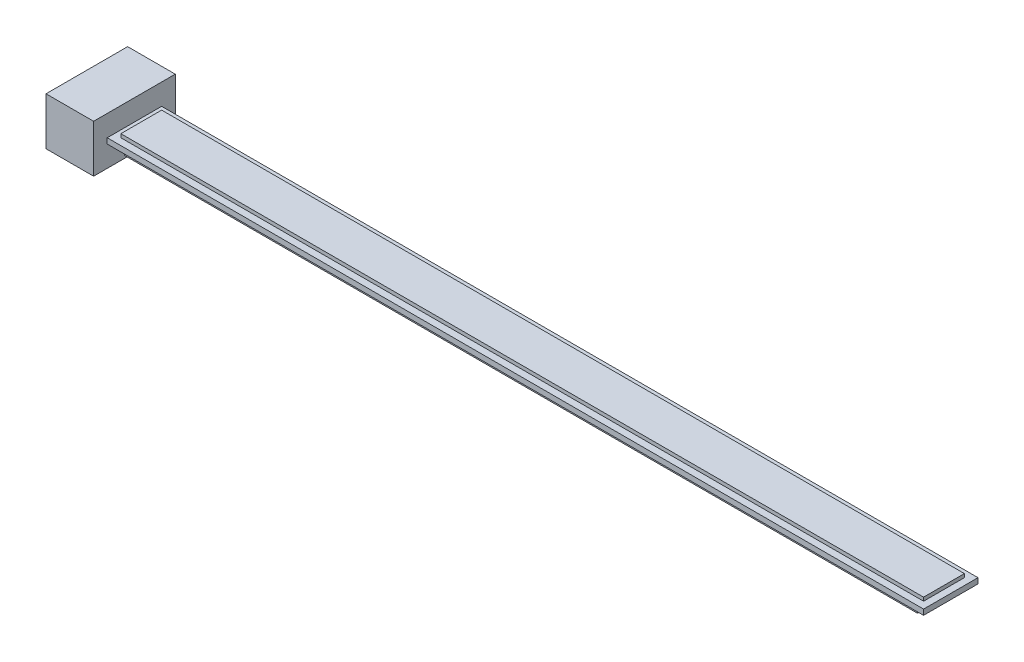
ISO-10303-21;
HEADER;
FILE_DESCRIPTION(('STEP AP214'),'2;1');
FILE_NAME('part.step','',(''),(''),'','','');
FILE_SCHEMA(('AUTOMOTIVE_DESIGN { 1 0 10303 214 1 1 1 1 }'));
ENDSEC;
DATA;
#1=APPLICATION_CONTEXT('core data for automotive mechanical design processes');
#2=APPLICATION_PROTOCOL_DEFINITION('international standard','automotive_design',2000,#1);
#3=PRODUCT_CONTEXT('',#1,'mechanical');
#4=PRODUCT('Part','Part','',(#3));
#5=PRODUCT_RELATED_PRODUCT_CATEGORY('part','',(#4));
#6=PRODUCT_DEFINITION_FORMATION('','',#4);
#7=PRODUCT_DEFINITION_CONTEXT('part definition',#1,'design');
#8=PRODUCT_DEFINITION('design','',#6,#7);
#9=PRODUCT_DEFINITION_SHAPE('','',#8);
#10=(LENGTH_UNIT() NAMED_UNIT(*) SI_UNIT(.MILLI.,.METRE.));
#11=(NAMED_UNIT(*) PLANE_ANGLE_UNIT() SI_UNIT($,.RADIAN.));
#12=(NAMED_UNIT(*) SI_UNIT($,.STERADIAN.) SOLID_ANGLE_UNIT());
#13=UNCERTAINTY_MEASURE_WITH_UNIT(LENGTH_MEASURE(1.E-05),#10,'distance_accuracy_value','');
#14=(GEOMETRIC_REPRESENTATION_CONTEXT(3) GLOBAL_UNCERTAINTY_ASSIGNED_CONTEXT((#13)) GLOBAL_UNIT_ASSIGNED_CONTEXT((#10,
#11,#12)) REPRESENTATION_CONTEXT('',''));
#15=CARTESIAN_POINT('',(0.,0.,0.));
#16=DIRECTION('',(0.,0.,1.));
#17=DIRECTION('',(1.,0.,0.));
#18=AXIS2_PLACEMENT_3D('',#15,#16,#17);
#19=CARTESIAN_POINT('',(617.5,-2.,50.));
#20=DIRECTION('',(0.,1.,0.));
#21=DIRECTION('',(0.,0.,1.));
#22=AXIS2_PLACEMENT_3D('',#19,#20,#21);
#23=PLANE('',#22);
#24=DIRECTION('',(1.,0.,0.));
#25=VECTOR('',#24,1.);
#26=CARTESIAN_POINT('',(26.1029293776079,-2.,23.1811179422744));
#27=LINE('',#26,#25);
#28=CARTESIAN_POINT('',(26.1029293776079,-2.,23.1811179422744));
#29=VERTEX_POINT('',#28);
#30=CARTESIAN_POINT('',(608.897070622392,-2.,23.1811179422744));
#31=VERTEX_POINT('',#30);
#32=EDGE_CURVE('E205',#29,#31,#27,.T.);
#33=ORIENTED_EDGE('',*,*,#32,.T.);
#34=DIRECTION('',(0.,0.,-1.));
#35=VECTOR('',#34,1.);
#36=CARTESIAN_POINT('',(608.897070622392,-2.,14.0892751986402));
#37=LINE('',#36,#35);
#38=CARTESIAN_POINT('',(608.897070622392,-2.,14.0892751986402));
#39=VERTEX_POINT('',#38);
#40=EDGE_CURVE('E179',#31,#39,#37,.T.);
#41=ORIENTED_EDGE('',*,*,#40,.T.);
#42=DIRECTION('',(-1.,0.,0.));
#43=VECTOR('',#42,1.);
#44=CARTESIAN_POINT('',(26.1029293776079,-2.,14.0892751986402));
#45=LINE('',#44,#43);
#46=CARTESIAN_POINT('',(26.1029293776079,-2.,14.0892751986402));
#47=VERTEX_POINT('',#46);
#48=EDGE_CURVE('E195',#39,#47,#45,.T.);
#49=ORIENTED_EDGE('',*,*,#48,.T.);
#50=DIRECTION('',(0.,0.,1.));
#51=VECTOR('',#50,1.);
#52=CARTESIAN_POINT('',(26.1029293776079,-2.,14.0892751986402));
#53=LINE('',#52,#51);
#54=EDGE_CURVE('E52',#47,#29,#53,.T.);
#55=ORIENTED_EDGE('',*,*,#54,.T.);
#56=EDGE_LOOP('',(#33,#41,#49,#55));
#57=FACE_BOUND('',#56,.T.);
#58=DIRECTION('',(0.,0.,-1.));
#59=VECTOR('',#58,1.);
#60=CARTESIAN_POINT('',(17.5,-2.,50.));
#61=LINE('',#60,#59);
#62=CARTESIAN_POINT('',(17.5,-1.99999999999999,50.));
#63=VERTEX_POINT('',#62);
#64=CARTESIAN_POINT('',(17.5,-2.,10.));
#65=VERTEX_POINT('',#64);
#66=EDGE_CURVE('E278',#63,#65,#61,.T.);
#67=ORIENTED_EDGE('',*,*,#66,.T.);
#68=DIRECTION('',(-1.,0.,0.));
#69=VECTOR('',#68,1.);
#70=CARTESIAN_POINT('',(617.5,-2.,10.));
#71=LINE('',#70,#69);
#72=CARTESIAN_POINT('',(617.5,-2.,10.));
#73=VERTEX_POINT('',#72);
#74=EDGE_CURVE('E284',#73,#65,#71,.T.);
#75=ORIENTED_EDGE('',*,*,#74,.F.);
#76=DIRECTION('',(0.,0.,-1.));
#77=VECTOR('',#76,1.);
#78=CARTESIAN_POINT('',(617.5,-2.,50.));
#79=LINE('',#78,#77);
#80=CARTESIAN_POINT('',(617.5,-2.,50.));
#81=VERTEX_POINT('',#80);
#82=EDGE_CURVE('E282',#81,#73,#79,.T.);
#83=ORIENTED_EDGE('',*,*,#82,.F.);
#84=DIRECTION('',(-1.,0.,0.));
#85=VECTOR('',#84,1.);
#86=CARTESIAN_POINT('',(617.5,-2.,50.));
#87=LINE('',#86,#85);
#88=EDGE_CURVE('E295',#81,#63,#87,.T.);
#89=ORIENTED_EDGE('',*,*,#88,.T.);
#90=EDGE_LOOP('',(#67,#75,#83,#89));
#91=FACE_BOUND('',#90,.T.);
#92=DIRECTION('',(0.,0.,1.));
#93=VECTOR('',#92,1.);
#94=CARTESIAN_POINT('',(608.897070622392,-2.,45.9107248013598));
#95=LINE('',#94,#93);
#96=CARTESIAN_POINT('',(608.897070622392,-2.,36.8188820577256));
#97=VERTEX_POINT('',#96);
#98=CARTESIAN_POINT('',(608.897070622392,-2.,45.9107248013598));
#99=VERTEX_POINT('',#98);
#100=EDGE_CURVE('E184',#97,#99,#95,.T.);
#101=ORIENTED_EDGE('',*,*,#100,.F.);
#102=DIRECTION('',(1.,0.,0.));
#103=VECTOR('',#102,1.);
#104=CARTESIAN_POINT('',(26.1029293776079,-2.,36.8188820577256));
#105=LINE('',#104,#103);
#106=CARTESIAN_POINT('',(26.1029293776079,-2.,36.8188820577256));
#107=VERTEX_POINT('',#106);
#108=EDGE_CURVE('E218',#107,#97,#105,.T.);
#109=ORIENTED_EDGE('',*,*,#108,.F.);
#110=DIRECTION('',(0.,0.,-1.));
#111=VECTOR('',#110,1.);
#112=CARTESIAN_POINT('',(26.1029293776079,-2.,45.9107248013598));
#113=LINE('',#112,#111);
#114=CARTESIAN_POINT('',(26.1029293776079,-2.,45.9107248013598));
#115=VERTEX_POINT('',#114);
#116=EDGE_CURVE('E228',#115,#107,#113,.T.);
#117=ORIENTED_EDGE('',*,*,#116,.F.);
#118=DIRECTION('',(-1.,0.,0.));
#119=VECTOR('',#118,1.);
#120=CARTESIAN_POINT('',(26.1029293776079,-2.,45.9107248013598));
#121=LINE('',#120,#119);
#122=EDGE_CURVE('E60',#99,#115,#121,.T.);
#123=ORIENTED_EDGE('',*,*,#122,.F.);
#124=EDGE_LOOP('',(#101,#109,#117,#123));
#125=FACE_BOUND('',#124,.T.);
#126=ADVANCED_FACE('F37',(#57,#91,#125),#23,.F.);
#127=CARTESIAN_POINT('',(17.5,17.5,60.));
#128=DIRECTION('',(1.,0.,0.));
#129=DIRECTION('',(0.,1.,0.));
#130=AXIS2_PLACEMENT_3D('',#127,#128,#129);
#131=PLANE('',#130);
#132=DIRECTION('',(0.,-1.,0.));
#133=VECTOR('',#132,1.);
#134=CARTESIAN_POINT('',(17.5,17.5,0.));
#135=LINE('',#134,#133);
#136=CARTESIAN_POINT('',(17.5,17.5,0.));
#137=VERTEX_POINT('',#136);
#138=CARTESIAN_POINT('',(17.5,-17.5,0.));
#139=VERTEX_POINT('',#138);
#140=EDGE_CURVE('E317',#137,#139,#135,.T.);
#141=ORIENTED_EDGE('',*,*,#140,.F.);
#142=DIRECTION('',(0.,0.,-1.));
#143=VECTOR('',#142,1.);
#144=CARTESIAN_POINT('',(17.5,17.5,60.));
#145=LINE('',#144,#143);
#146=CARTESIAN_POINT('',(17.5,17.5,60.));
#147=VERTEX_POINT('',#146);
#148=EDGE_CURVE('E45',#147,#137,#145,.T.);
#149=ORIENTED_EDGE('',*,*,#148,.F.);
#150=DIRECTION('',(0.,-1.,0.));
#151=VECTOR('',#150,1.);
#152=CARTESIAN_POINT('',(17.5,17.5,60.));
#153=LINE('',#152,#151);
#154=CARTESIAN_POINT('',(17.5,-17.5,60.));
#155=VERTEX_POINT('',#154);
#156=EDGE_CURVE('E305',#147,#155,#153,.T.);
#157=ORIENTED_EDGE('',*,*,#156,.T.);
#158=DIRECTION('',(0.,0.,-1.));
#159=VECTOR('',#158,1.);
#160=CARTESIAN_POINT('',(17.5,-17.5,60.));
#161=LINE('',#160,#159);
#162=EDGE_CURVE('E11',#155,#139,#161,.T.);
#163=ORIENTED_EDGE('',*,*,#162,.T.);
#164=EDGE_LOOP('',(#141,#149,#157,#163));
#165=FACE_BOUND('',#164,.T.);
#166=DIRECTION('',(0.,0.,1.));
#167=VECTOR('',#166,1.);
#168=CARTESIAN_POINT('',(17.5,2.,50.));
#169=LINE('',#168,#167);
#170=CARTESIAN_POINT('',(17.5,2.,10.));
#171=VERTEX_POINT('',#170);
#172=CARTESIAN_POINT('',(17.5,2.,50.));
#173=VERTEX_POINT('',#172);
#174=EDGE_CURVE('E287',#171,#173,#169,.T.);
#175=ORIENTED_EDGE('',*,*,#174,.F.);
#176=DIRECTION('',(0.,1.,0.));
#177=VECTOR('',#176,1.);
#178=CARTESIAN_POINT('',(17.5,2.,10.));
#179=LINE('',#178,#177);
#180=EDGE_CURVE('E266',#65,#171,#179,.T.);
#181=ORIENTED_EDGE('',*,*,#180,.F.);
#182=ORIENTED_EDGE('',*,*,#66,.F.);
#183=DIRECTION('',(0.,-1.,0.));
#184=VECTOR('',#183,1.);
#185=CARTESIAN_POINT('',(17.5,2.,50.));
#186=LINE('',#185,#184);
#187=EDGE_CURVE('E289',#173,#63,#186,.T.);
#188=ORIENTED_EDGE('',*,*,#187,.F.);
#189=EDGE_LOOP('',(#175,#181,#182,#188));
#190=FACE_BOUND('',#189,.T.);
#191=ADVANCED_FACE('F334',(#165,#190),#131,.T.);
#192=CARTESIAN_POINT('',(-17.5,-17.5,60.));
#193=DIRECTION('',(0.,1.,0.));
#194=DIRECTION('',(0.,0.,1.));
#195=AXIS2_PLACEMENT_3D('',#192,#193,#194);
#196=PLANE('',#195);
#197=DIRECTION('',(1.,0.,0.));
#198=VECTOR('',#197,1.);
#199=CARTESIAN_POINT('',(-17.5,-17.5,0.));
#200=LINE('',#199,#198);
#201=CARTESIAN_POINT('',(-17.5,-17.5,0.));
#202=VERTEX_POINT('',#201);
#203=EDGE_CURVE('E302',#202,#139,#200,.T.);
#204=ORIENTED_EDGE('',*,*,#203,.T.);
#205=ORIENTED_EDGE('',*,*,#162,.F.);
#206=DIRECTION('',(1.,0.,0.));
#207=VECTOR('',#206,1.);
#208=CARTESIAN_POINT('',(-17.5,-17.5,60.));
#209=LINE('',#208,#207);
#210=CARTESIAN_POINT('',(-17.5,-17.5,60.));
#211=VERTEX_POINT('',#210);
#212=EDGE_CURVE('E303',#211,#155,#209,.T.);
#213=ORIENTED_EDGE('',*,*,#212,.F.);
#214=DIRECTION('',(0.,0.,-1.));
#215=VECTOR('',#214,1.);
#216=CARTESIAN_POINT('',(-17.5,-17.5,60.));
#217=LINE('',#216,#215);
#218=EDGE_CURVE('E314',#211,#202,#217,.T.);
#219=ORIENTED_EDGE('',*,*,#218,.T.);
#220=EDGE_LOOP('',(#204,#205,#213,#219));
#221=FACE_BOUND('',#220,.T.);
#222=ADVANCED_FACE('F39',(#221),#196,.F.);
#223=CARTESIAN_POINT('',(-17.5,17.5,60.));
#224=DIRECTION('',(0.,1.,0.));
#225=DIRECTION('',(0.,0.,1.));
#226=AXIS2_PLACEMENT_3D('',#223,#224,#225);
#227=PLANE('',#226);
#228=DIRECTION('',(1.,0.,0.));
#229=VECTOR('',#228,1.);
#230=CARTESIAN_POINT('',(-17.5,17.5,0.));
#231=LINE('',#230,#229);
#232=CARTESIAN_POINT('',(-17.5,17.5,0.));
#233=VERTEX_POINT('',#232);
#234=EDGE_CURVE('E320',#233,#137,#231,.T.);
#235=ORIENTED_EDGE('',*,*,#234,.F.);
#236=DIRECTION('',(0.,0.,-1.));
#237=VECTOR('',#236,1.);
#238=CARTESIAN_POINT('',(-17.5,17.5,60.));
#239=LINE('',#238,#237);
#240=CARTESIAN_POINT('',(-17.5,17.5,60.));
#241=VERTEX_POINT('',#240);
#242=EDGE_CURVE('E326',#241,#233,#239,.T.);
#243=ORIENTED_EDGE('',*,*,#242,.F.);
#244=DIRECTION('',(1.,0.,0.));
#245=VECTOR('',#244,1.);
#246=CARTESIAN_POINT('',(-17.5,17.5,60.));
#247=LINE('',#246,#245);
#248=EDGE_CURVE('E309',#241,#147,#247,.T.);
#249=ORIENTED_EDGE('',*,*,#248,.T.);
#250=ORIENTED_EDGE('',*,*,#148,.T.);
#251=EDGE_LOOP('',(#235,#243,#249,#250));
#252=FACE_BOUND('',#251,.T.);
#253=ADVANCED_FACE('F330',(#252),#227,.T.);
#254=CARTESIAN_POINT('',(-17.5,17.5,60.));
#255=DIRECTION('',(1.,0.,0.));
#256=DIRECTION('',(0.,1.,0.));
#257=AXIS2_PLACEMENT_3D('',#254,#255,#256);
#258=PLANE('',#257);
#259=DIRECTION('',(0.,-1.,0.));
#260=VECTOR('',#259,1.);
#261=CARTESIAN_POINT('',(-17.5,17.5,0.));
#262=LINE('',#261,#260);
#263=EDGE_CURVE('E306',#233,#202,#262,.T.);
#264=ORIENTED_EDGE('',*,*,#263,.T.);
#265=ORIENTED_EDGE('',*,*,#218,.F.);
#266=DIRECTION('',(0.,-1.,0.));
#267=VECTOR('',#266,1.);
#268=CARTESIAN_POINT('',(-17.5,17.5,60.));
#269=LINE('',#268,#267);
#270=EDGE_CURVE('E312',#241,#211,#269,.T.);
#271=ORIENTED_EDGE('',*,*,#270,.F.);
#272=ORIENTED_EDGE('',*,*,#242,.T.);
#273=EDGE_LOOP('',(#264,#265,#271,#272));
#274=FACE_BOUND('',#273,.T.);
#275=ADVANCED_FACE('F343',(#274),#258,.F.);
#276=CARTESIAN_POINT('',(0.,0.,60.));
#277=DIRECTION('',(0.,0.,-1.));
#278=DIRECTION('',(-1.,0.,0.));
#279=AXIS2_PLACEMENT_3D('',#276,#277,#278);
#280=PLANE('',#279);
#281=ORIENTED_EDGE('',*,*,#212,.T.);
#282=ORIENTED_EDGE('',*,*,#156,.F.);
#283=ORIENTED_EDGE('',*,*,#248,.F.);
#284=ORIENTED_EDGE('',*,*,#270,.T.);
#285=EDGE_LOOP('',(#281,#282,#283,#284));
#286=FACE_BOUND('',#285,.T.);
#287=ADVANCED_FACE('F348',(#286),#280,.F.);
#288=CARTESIAN_POINT('',(0.,0.,0.));
#289=DIRECTION('',(0.,0.,-1.));
#290=DIRECTION('',(-1.,0.,0.));
#291=AXIS2_PLACEMENT_3D('',#288,#289,#290);
#292=PLANE('',#291);
#293=ORIENTED_EDGE('',*,*,#203,.F.);
#294=ORIENTED_EDGE('',*,*,#263,.F.);
#295=ORIENTED_EDGE('',*,*,#234,.T.);
#296=ORIENTED_EDGE('',*,*,#140,.T.);
#297=EDGE_LOOP('',(#293,#294,#295,#296));
#298=FACE_BOUND('',#297,.T.);
#299=ADVANCED_FACE('F340',(#298),#292,.T.);
#300=CARTESIAN_POINT('',(617.5,2.,10.));
#301=DIRECTION('',(0.,0.,1.));
#302=DIRECTION('',(1.,0.,0.));
#303=AXIS2_PLACEMENT_3D('',#300,#301,#302);
#304=PLANE('',#303);
#305=ORIENTED_EDGE('',*,*,#180,.T.);
#306=DIRECTION('',(-1.,0.,0.));
#307=VECTOR('',#306,1.);
#308=CARTESIAN_POINT('',(617.5,2.,10.));
#309=LINE('',#308,#307);
#310=CARTESIAN_POINT('',(617.5,2.,10.));
#311=VERTEX_POINT('',#310);
#312=EDGE_CURVE('E300',#311,#171,#309,.T.);
#313=ORIENTED_EDGE('',*,*,#312,.F.);
#314=DIRECTION('',(0.,1.,0.));
#315=VECTOR('',#314,1.);
#316=CARTESIAN_POINT('',(617.5,2.,10.));
#317=LINE('',#316,#315);
#318=EDGE_CURVE('E274',#73,#311,#317,.T.);
#319=ORIENTED_EDGE('',*,*,#318,.F.);
#320=ORIENTED_EDGE('',*,*,#74,.T.);
#321=EDGE_LOOP('',(#305,#313,#319,#320));
#322=FACE_BOUND('',#321,.T.);
#323=ADVANCED_FACE('F355',(#322),#304,.F.);
#324=CARTESIAN_POINT('',(617.5,2.,50.));
#325=DIRECTION('',(0.,-1.,0.));
#326=DIRECTION('',(0.,0.,-1.));
#327=AXIS2_PLACEMENT_3D('',#324,#325,#326);
#328=PLANE('',#327);
#329=DIRECTION('',(0.,0.,1.));
#330=VECTOR('',#329,1.);
#331=CARTESIAN_POINT('',(22.5,2.,15.));
#332=LINE('',#331,#330);
#333=CARTESIAN_POINT('',(22.5,2.,15.));
#334=VERTEX_POINT('',#333);
#335=CARTESIAN_POINT('',(22.5,2.,45.));
#336=VERTEX_POINT('',#335);
#337=EDGE_CURVE('E248',#334,#336,#332,.T.);
#338=ORIENTED_EDGE('',*,*,#337,.F.);
#339=DIRECTION('',(1.,0.,0.));
#340=VECTOR('',#339,1.);
#341=CARTESIAN_POINT('',(22.5,2.,15.));
#342=LINE('',#341,#340);
#343=CARTESIAN_POINT('',(612.5,2.,15.));
#344=VERTEX_POINT('',#343);
#345=EDGE_CURVE('E243',#334,#344,#342,.T.);
#346=ORIENTED_EDGE('',*,*,#345,.T.);
#347=DIRECTION('',(0.,0.,1.));
#348=VECTOR('',#347,1.);
#349=CARTESIAN_POINT('',(612.5,2.,15.));
#350=LINE('',#349,#348);
#351=CARTESIAN_POINT('',(612.5,2.,45.));
#352=VERTEX_POINT('',#351);
#353=EDGE_CURVE('E258',#344,#352,#350,.T.);
#354=ORIENTED_EDGE('',*,*,#353,.T.);
#355=DIRECTION('',(1.,0.,0.));
#356=VECTOR('',#355,1.);
#357=CARTESIAN_POINT('',(22.5,2.,45.));
#358=LINE('',#357,#356);
#359=EDGE_CURVE('E261',#336,#352,#358,.T.);
#360=ORIENTED_EDGE('',*,*,#359,.F.);
#361=EDGE_LOOP('',(#338,#346,#354,#360));
#362=FACE_BOUND('',#361,.T.);
#363=ORIENTED_EDGE('',*,*,#174,.T.);
#364=DIRECTION('',(-1.,0.,0.));
#365=VECTOR('',#364,1.);
#366=CARTESIAN_POINT('',(617.5,2.,50.));
#367=LINE('',#366,#365);
#368=CARTESIAN_POINT('',(617.5,2.,50.));
#369=VERTEX_POINT('',#368);
#370=EDGE_CURVE('E297',#369,#173,#367,.T.);
#371=ORIENTED_EDGE('',*,*,#370,.F.);
#372=DIRECTION('',(0.,0.,1.));
#373=VECTOR('',#372,1.);
#374=CARTESIAN_POINT('',(617.5,2.,50.));
#375=LINE('',#374,#373);
#376=EDGE_CURVE('E277',#311,#369,#375,.T.);
#377=ORIENTED_EDGE('',*,*,#376,.F.);
#378=ORIENTED_EDGE('',*,*,#312,.T.);
#379=EDGE_LOOP('',(#363,#371,#377,#378));
#380=FACE_BOUND('',#379,.T.);
#381=ADVANCED_FACE('F373',(#362,#380),#328,.F.);
#382=CARTESIAN_POINT('',(617.5,2.,50.));
#383=DIRECTION('',(0.,0.,-1.));
#384=DIRECTION('',(-1.,0.,0.));
#385=AXIS2_PLACEMENT_3D('',#382,#383,#384);
#386=PLANE('',#385);
#387=ORIENTED_EDGE('',*,*,#187,.T.);
#388=ORIENTED_EDGE('',*,*,#88,.F.);
#389=DIRECTION('',(0.,-1.,0.));
#390=VECTOR('',#389,1.);
#391=CARTESIAN_POINT('',(617.5,2.,50.));
#392=LINE('',#391,#390);
#393=EDGE_CURVE('E280',#369,#81,#392,.T.);
#394=ORIENTED_EDGE('',*,*,#393,.F.);
#395=ORIENTED_EDGE('',*,*,#370,.T.);
#396=EDGE_LOOP('',(#387,#388,#394,#395));
#397=FACE_BOUND('',#396,.T.);
#398=ADVANCED_FACE('F370',(#397),#386,.F.);
#399=CARTESIAN_POINT('',(617.5,0.,0.));
#400=DIRECTION('',(1.,0.,0.));
#401=DIRECTION('',(0.,0.,-1.));
#402=AXIS2_PLACEMENT_3D('',#399,#400,#401);
#403=PLANE('',#402);
#404=ORIENTED_EDGE('',*,*,#318,.T.);
#405=ORIENTED_EDGE('',*,*,#376,.T.);
#406=ORIENTED_EDGE('',*,*,#393,.T.);
#407=ORIENTED_EDGE('',*,*,#82,.T.);
#408=EDGE_LOOP('',(#404,#405,#406,#407));
#409=FACE_BOUND('',#408,.T.);
#410=ADVANCED_FACE('F368',(#409),#403,.T.);
#411=CARTESIAN_POINT('',(22.5,4.6,15.));
#412=DIRECTION('',(0.,0.,-1.));
#413=DIRECTION('',(-1.,0.,0.));
#414=AXIS2_PLACEMENT_3D('',#411,#412,#413);
#415=PLANE('',#414);
#416=ORIENTED_EDGE('',*,*,#345,.F.);
#417=DIRECTION('',(0.,-1.,0.));
#418=VECTOR('',#417,1.);
#419=CARTESIAN_POINT('',(22.5,4.6,15.));
#420=LINE('',#419,#418);
#421=CARTESIAN_POINT('',(22.5,4.6,15.));
#422=VERTEX_POINT('',#421);
#423=EDGE_CURVE('E264',#422,#334,#420,.T.);
#424=ORIENTED_EDGE('',*,*,#423,.F.);
#425=DIRECTION('',(1.,0.,0.));
#426=VECTOR('',#425,1.);
#427=CARTESIAN_POINT('',(22.5,4.6,15.));
#428=LINE('',#427,#426);
#429=CARTESIAN_POINT('',(612.5,4.6,15.));
#430=VERTEX_POINT('',#429);
#431=EDGE_CURVE('E244',#422,#430,#428,.T.);
#432=ORIENTED_EDGE('',*,*,#431,.T.);
#433=DIRECTION('',(0.,-1.,0.));
#434=VECTOR('',#433,1.);
#435=CARTESIAN_POINT('',(612.5,4.6,15.));
#436=LINE('',#435,#434);
#437=EDGE_CURVE('E255',#430,#344,#436,.T.);
#438=ORIENTED_EDGE('',*,*,#437,.T.);
#439=EDGE_LOOP('',(#416,#424,#432,#438));
#440=FACE_BOUND('',#439,.T.);
#441=ADVANCED_FACE('F430',(#440),#415,.T.);
#442=CARTESIAN_POINT('',(22.5,4.6,15.));
#443=DIRECTION('',(1.,0.,0.));
#444=DIRECTION('',(0.,0.,-1.));
#445=AXIS2_PLACEMENT_3D('',#442,#443,#444);
#446=PLANE('',#445);
#447=ORIENTED_EDGE('',*,*,#337,.T.);
#448=DIRECTION('',(0.,-1.,0.));
#449=VECTOR('',#448,1.);
#450=CARTESIAN_POINT('',(22.5,4.6,45.));
#451=LINE('',#450,#449);
#452=CARTESIAN_POINT('',(22.5,4.6,45.));
#453=VERTEX_POINT('',#452);
#454=EDGE_CURVE('E267',#453,#336,#451,.T.);
#455=ORIENTED_EDGE('',*,*,#454,.F.);
#456=DIRECTION('',(0.,0.,1.));
#457=VECTOR('',#456,1.);
#458=CARTESIAN_POINT('',(22.5,4.6,15.));
#459=LINE('',#458,#457);
#460=EDGE_CURVE('E253',#422,#453,#459,.T.);
#461=ORIENTED_EDGE('',*,*,#460,.F.);
#462=ORIENTED_EDGE('',*,*,#423,.T.);
#463=EDGE_LOOP('',(#447,#455,#461,#462));
#464=FACE_BOUND('',#463,.T.);
#465=ADVANCED_FACE('F426',(#464),#446,.F.);
#466=CARTESIAN_POINT('',(22.5,4.6,45.));
#467=DIRECTION('',(0.,0.,-1.));
#468=DIRECTION('',(-1.,0.,0.));
#469=AXIS2_PLACEMENT_3D('',#466,#467,#468);
#470=PLANE('',#469);
#471=ORIENTED_EDGE('',*,*,#359,.T.);
#472=DIRECTION('',(0.,-1.,0.));
#473=VECTOR('',#472,1.);
#474=CARTESIAN_POINT('',(612.5,4.6,45.));
#475=LINE('',#474,#473);
#476=CARTESIAN_POINT('',(612.5,4.6,45.));
#477=VERTEX_POINT('',#476);
#478=EDGE_CURVE('E270',#477,#352,#475,.T.);
#479=ORIENTED_EDGE('',*,*,#478,.F.);
#480=DIRECTION('',(1.,0.,0.));
#481=VECTOR('',#480,1.);
#482=CARTESIAN_POINT('',(22.5,4.6,45.));
#483=LINE('',#482,#481);
#484=EDGE_CURVE('E251',#453,#477,#483,.T.);
#485=ORIENTED_EDGE('',*,*,#484,.F.);
#486=ORIENTED_EDGE('',*,*,#454,.T.);
#487=EDGE_LOOP('',(#471,#479,#485,#486));
#488=FACE_BOUND('',#487,.T.);
#489=ADVANCED_FACE('F429',(#488),#470,.F.);
#490=CARTESIAN_POINT('',(612.5,4.6,15.));
#491=DIRECTION('',(1.,0.,0.));
#492=DIRECTION('',(0.,0.,-1.));
#493=AXIS2_PLACEMENT_3D('',#490,#491,#492);
#494=PLANE('',#493);
#495=ORIENTED_EDGE('',*,*,#353,.F.);
#496=ORIENTED_EDGE('',*,*,#437,.F.);
#497=DIRECTION('',(0.,0.,1.));
#498=VECTOR('',#497,1.);
#499=CARTESIAN_POINT('',(612.5,4.6,15.));
#500=LINE('',#499,#498);
#501=EDGE_CURVE('E247',#430,#477,#500,.T.);
#502=ORIENTED_EDGE('',*,*,#501,.T.);
#503=ORIENTED_EDGE('',*,*,#478,.T.);
#504=EDGE_LOOP('',(#495,#496,#502,#503));
#505=FACE_BOUND('',#504,.T.);
#506=ADVANCED_FACE('F424',(#505),#494,.T.);
#507=CARTESIAN_POINT('',(0.,4.6,0.));
#508=DIRECTION('',(0.,-1.,0.));
#509=DIRECTION('',(0.,0.,-1.));
#510=AXIS2_PLACEMENT_3D('',#507,#508,#509);
#511=PLANE('',#510);
#512=ORIENTED_EDGE('',*,*,#431,.F.);
#513=ORIENTED_EDGE('',*,*,#460,.T.);
#514=ORIENTED_EDGE('',*,*,#484,.T.);
#515=ORIENTED_EDGE('',*,*,#501,.F.);
#516=EDGE_LOOP('',(#512,#513,#514,#515));
#517=FACE_BOUND('',#516,.T.);
#518=ADVANCED_FACE('F418',(#517),#511,.F.);
#519=CARTESIAN_POINT('',(608.897070622392,-7.,45.9107248013598));
#520=DIRECTION('',(-1.,0.,0.));
#521=DIRECTION('',(0.,0.,1.));
#522=AXIS2_PLACEMENT_3D('',#519,#520,#521);
#523=PLANE('',#522);
#524=ORIENTED_EDGE('',*,*,#100,.T.);
#525=DIRECTION('',(0.,1.,0.));
#526=VECTOR('',#525,1.);
#527=CARTESIAN_POINT('',(608.897070622392,-7.,45.9107248013598));
#528=LINE('',#527,#526);
#529=CARTESIAN_POINT('',(608.897070622392,-7.,45.9107248013598));
#530=VERTEX_POINT('',#529);
#531=EDGE_CURVE('E241',#530,#99,#528,.T.);
#532=ORIENTED_EDGE('',*,*,#531,.F.);
#533=DIRECTION('',(0.,0.,1.));
#534=VECTOR('',#533,1.);
#535=CARTESIAN_POINT('',(608.897070622392,-7.,45.9107248013598));
#536=LINE('',#535,#534);
#537=CARTESIAN_POINT('',(608.897070622392,-7.,36.8188820577256));
#538=VERTEX_POINT('',#537);
#539=EDGE_CURVE('E214',#538,#530,#536,.T.);
#540=ORIENTED_EDGE('',*,*,#539,.F.);
#541=DIRECTION('',(0.,1.,0.));
#542=VECTOR('',#541,1.);
#543=CARTESIAN_POINT('',(608.897070622392,-7.,36.8188820577256));
#544=LINE('',#543,#542);
#545=EDGE_CURVE('E224',#538,#97,#544,.T.);
#546=ORIENTED_EDGE('',*,*,#545,.T.);
#547=EDGE_LOOP('',(#524,#532,#540,#546));
#548=FACE_BOUND('',#547,.T.);
#549=ADVANCED_FACE('F402',(#548),#523,.F.);
#550=CARTESIAN_POINT('',(26.1029293776079,-7.,45.9107248013598));
#551=DIRECTION('',(0.,0.,-1.));
#552=DIRECTION('',(-1.,0.,0.));
#553=AXIS2_PLACEMENT_3D('',#550,#551,#552);
#554=PLANE('',#553);
#555=ORIENTED_EDGE('',*,*,#122,.T.);
#556=DIRECTION('',(0.,1.,0.));
#557=VECTOR('',#556,1.);
#558=CARTESIAN_POINT('',(26.1029293776079,-7.,45.9107248013598));
#559=LINE('',#558,#557);
#560=CARTESIAN_POINT('',(26.1029293776079,-7.,45.9107248013598));
#561=VERTEX_POINT('',#560);
#562=EDGE_CURVE('E238',#561,#115,#559,.T.);
#563=ORIENTED_EDGE('',*,*,#562,.F.);
#564=DIRECTION('',(-1.,0.,0.));
#565=VECTOR('',#564,1.);
#566=CARTESIAN_POINT('',(26.1029293776079,-7.,45.9107248013598));
#567=LINE('',#566,#565);
#568=EDGE_CURVE('E217',#530,#561,#567,.T.);
#569=ORIENTED_EDGE('',*,*,#568,.F.);
#570=ORIENTED_EDGE('',*,*,#531,.T.);
#571=EDGE_LOOP('',(#555,#563,#569,#570));
#572=FACE_BOUND('',#571,.T.);
#573=ADVANCED_FACE('F410',(#572),#554,.F.);
#574=CARTESIAN_POINT('',(26.1029293776079,-7.,45.9107248013598));
#575=DIRECTION('',(1.,0.,0.));
#576=DIRECTION('',(0.,0.,-1.));
#577=AXIS2_PLACEMENT_3D('',#574,#575,#576);
#578=PLANE('',#577);
#579=ORIENTED_EDGE('',*,*,#116,.T.);
#580=DIRECTION('',(0.,1.,0.));
#581=VECTOR('',#580,1.);
#582=CARTESIAN_POINT('',(26.1029293776079,-7.,36.8188820577256));
#583=LINE('',#582,#581);
#584=CARTESIAN_POINT('',(26.1029293776079,-7.,36.8188820577256));
#585=VERTEX_POINT('',#584);
#586=EDGE_CURVE('E235',#585,#107,#583,.T.);
#587=ORIENTED_EDGE('',*,*,#586,.F.);
#588=DIRECTION('',(0.,0.,-1.));
#589=VECTOR('',#588,1.);
#590=CARTESIAN_POINT('',(26.1029293776079,-7.,45.9107248013598));
#591=LINE('',#590,#589);
#592=EDGE_CURVE('E220',#561,#585,#591,.T.);
#593=ORIENTED_EDGE('',*,*,#592,.F.);
#594=ORIENTED_EDGE('',*,*,#562,.T.);
#595=EDGE_LOOP('',(#579,#587,#593,#594));
#596=FACE_BOUND('',#595,.T.);
#597=ADVANCED_FACE('F408',(#596),#578,.F.);
#598=CARTESIAN_POINT('',(26.1029293776079,-7.,36.8188820577256));
#599=DIRECTION('',(0.,0.,1.));
#600=DIRECTION('',(1.,0.,0.));
#601=AXIS2_PLACEMENT_3D('',#598,#599,#600);
#602=PLANE('',#601);
#603=ORIENTED_EDGE('',*,*,#108,.T.);
#604=ORIENTED_EDGE('',*,*,#545,.F.);
#605=DIRECTION('',(1.,0.,0.));
#606=VECTOR('',#605,1.);
#607=CARTESIAN_POINT('',(26.1029293776079,-7.,36.8188820577256));
#608=LINE('',#607,#606);
#609=EDGE_CURVE('E222',#585,#538,#608,.T.);
#610=ORIENTED_EDGE('',*,*,#609,.F.);
#611=ORIENTED_EDGE('',*,*,#586,.T.);
#612=EDGE_LOOP('',(#603,#604,#610,#611));
#613=FACE_BOUND('',#612,.T.);
#614=ADVANCED_FACE('F398',(#613),#602,.F.);
#615=CARTESIAN_POINT('',(0.,-7.,0.));
#616=DIRECTION('',(0.,-1.,0.));
#617=DIRECTION('',(0.,0.,-1.));
#618=AXIS2_PLACEMENT_3D('',#615,#616,#617);
#619=PLANE('',#618);
#620=ORIENTED_EDGE('',*,*,#539,.T.);
#621=ORIENTED_EDGE('',*,*,#568,.T.);
#622=ORIENTED_EDGE('',*,*,#592,.T.);
#623=ORIENTED_EDGE('',*,*,#609,.T.);
#624=EDGE_LOOP('',(#620,#621,#622,#623));
#625=FACE_BOUND('',#624,.T.);
#626=ADVANCED_FACE('F404',(#625),#619,.T.);
#627=CARTESIAN_POINT('',(608.897070622392,-7.,14.0892751986402));
#628=DIRECTION('',(1.,0.,0.));
#629=DIRECTION('',(0.,0.,-1.));
#630=AXIS2_PLACEMENT_3D('',#627,#628,#629);
#631=PLANE('',#630);
#632=ORIENTED_EDGE('',*,*,#40,.F.);
#633=DIRECTION('',(0.,1.,0.));
#634=VECTOR('',#633,1.);
#635=CARTESIAN_POINT('',(608.897070622392,-7.,23.1811179422744));
#636=LINE('',#635,#634);
#637=CARTESIAN_POINT('',(608.897070622392,-7.,23.1811179422744));
#638=VERTEX_POINT('',#637);
#639=EDGE_CURVE('E173',#638,#31,#636,.T.);
#640=ORIENTED_EDGE('',*,*,#639,.F.);
#641=DIRECTION('',(0.,0.,-1.));
#642=VECTOR('',#641,1.);
#643=CARTESIAN_POINT('',(608.897070622392,-7.,14.0892751986402));
#644=LINE('',#643,#642);
#645=CARTESIAN_POINT('',(608.897070622392,-7.,14.0892751986402));
#646=VERTEX_POINT('',#645);
#647=EDGE_CURVE('E176',#638,#646,#644,.T.);
#648=ORIENTED_EDGE('',*,*,#647,.T.);
#649=DIRECTION('',(0.,1.,0.));
#650=VECTOR('',#649,1.);
#651=CARTESIAN_POINT('',(608.897070622392,-7.,14.0892751986402));
#652=LINE('',#651,#650);
#653=EDGE_CURVE('E203',#646,#39,#652,.T.);
#654=ORIENTED_EDGE('',*,*,#653,.T.);
#655=EDGE_LOOP('',(#632,#640,#648,#654));
#656=FACE_BOUND('',#655,.T.);
#657=ADVANCED_FACE('F175',(#656),#631,.T.);
#658=CARTESIAN_POINT('',(26.1029293776079,-7.,23.1811179422744));
#659=DIRECTION('',(0.,0.,1.));
#660=DIRECTION('',(1.,0.,0.));
#661=AXIS2_PLACEMENT_3D('',#658,#659,#660);
#662=PLANE('',#661);
#663=ORIENTED_EDGE('',*,*,#32,.F.);
#664=DIRECTION('',(0.,1.,0.));
#665=VECTOR('',#664,1.);
#666=CARTESIAN_POINT('',(26.1029293776079,-7.,23.1811179422744));
#667=LINE('',#666,#665);
#668=CARTESIAN_POINT('',(26.1029293776079,-7.,23.1811179422744));
#669=VERTEX_POINT('',#668);
#670=EDGE_CURVE('E185',#669,#29,#667,.T.);
#671=ORIENTED_EDGE('',*,*,#670,.F.);
#672=DIRECTION('',(1.,0.,0.));
#673=VECTOR('',#672,1.);
#674=CARTESIAN_POINT('',(26.1029293776079,-7.,23.1811179422744));
#675=LINE('',#674,#673);
#676=EDGE_CURVE('E191',#669,#638,#675,.T.);
#677=ORIENTED_EDGE('',*,*,#676,.T.);
#678=ORIENTED_EDGE('',*,*,#639,.T.);
#679=EDGE_LOOP('',(#663,#671,#677,#678));
#680=FACE_BOUND('',#679,.T.);
#681=ADVANCED_FACE('F197',(#680),#662,.T.);
#682=CARTESIAN_POINT('',(26.1029293776079,-7.,14.0892751986402));
#683=DIRECTION('',(-1.,0.,0.));
#684=DIRECTION('',(0.,0.,1.));
#685=AXIS2_PLACEMENT_3D('',#682,#683,#684);
#686=PLANE('',#685);
#687=ORIENTED_EDGE('',*,*,#54,.F.);
#688=DIRECTION('',(0.,1.,0.));
#689=VECTOR('',#688,1.);
#690=CARTESIAN_POINT('',(26.1029293776079,-7.,14.0892751986402));
#691=LINE('',#690,#689);
#692=CARTESIAN_POINT('',(26.1029293776079,-7.,14.0892751986402));
#693=VERTEX_POINT('',#692);
#694=EDGE_CURVE('E211',#693,#47,#691,.T.);
#695=ORIENTED_EDGE('',*,*,#694,.F.);
#696=DIRECTION('',(0.,0.,1.));
#697=VECTOR('',#696,1.);
#698=CARTESIAN_POINT('',(26.1029293776079,-7.,14.0892751986402));
#699=LINE('',#698,#697);
#700=EDGE_CURVE('E198',#693,#669,#699,.T.);
#701=ORIENTED_EDGE('',*,*,#700,.T.);
#702=ORIENTED_EDGE('',*,*,#670,.T.);
#703=EDGE_LOOP('',(#687,#695,#701,#702));
#704=FACE_BOUND('',#703,.T.);
#705=ADVANCED_FACE('F555',(#704),#686,.T.);
#706=CARTESIAN_POINT('',(26.1029293776079,-7.,14.0892751986402));
#707=DIRECTION('',(0.,0.,-1.));
#708=DIRECTION('',(-1.,0.,0.));
#709=AXIS2_PLACEMENT_3D('',#706,#707,#708);
#710=PLANE('',#709);
#711=ORIENTED_EDGE('',*,*,#48,.F.);
#712=ORIENTED_EDGE('',*,*,#653,.F.);
#713=DIRECTION('',(-1.,0.,0.));
#714=VECTOR('',#713,1.);
#715=CARTESIAN_POINT('',(26.1029293776079,-7.,14.0892751986402));
#716=LINE('',#715,#714);
#717=EDGE_CURVE('E194',#646,#693,#716,.T.);
#718=ORIENTED_EDGE('',*,*,#717,.T.);
#719=ORIENTED_EDGE('',*,*,#694,.T.);
#720=EDGE_LOOP('',(#711,#712,#718,#719));
#721=FACE_BOUND('',#720,.T.);
#722=ADVANCED_FACE('F565',(#721),#710,.T.);
#723=CARTESIAN_POINT('',(0.,-7.,60.));
#724=DIRECTION('',(0.,-1.,0.));
#725=DIRECTION('',(0.,0.,1.));
#726=AXIS2_PLACEMENT_3D('',#723,#724,#725);
#727=PLANE('',#726);
#728=ORIENTED_EDGE('',*,*,#647,.F.);
#729=ORIENTED_EDGE('',*,*,#676,.F.);
#730=ORIENTED_EDGE('',*,*,#700,.F.);
#731=ORIENTED_EDGE('',*,*,#717,.F.);
#732=EDGE_LOOP('',(#728,#729,#730,#731));
#733=FACE_BOUND('',#732,.T.);
#734=ADVANCED_FACE('F189',(#733),#727,.T.);
#735=CLOSED_SHELL('',(#126,#191,#222,#253,#275,#287,#299,#323,#381,#398,#410,#441,#465,#489,
#506,#518,#549,#573,#597,#614,#626,#657,#681,#705,#722,#734));
#736=MANIFOLD_SOLID_BREP('B2',#735);
#737=ADVANCED_BREP_SHAPE_REPRESENTATION('',(#18,#736),#14);
#738=SHAPE_DEFINITION_REPRESENTATION(#9,#737);
ENDSEC;
END-ISO-10303-21;
